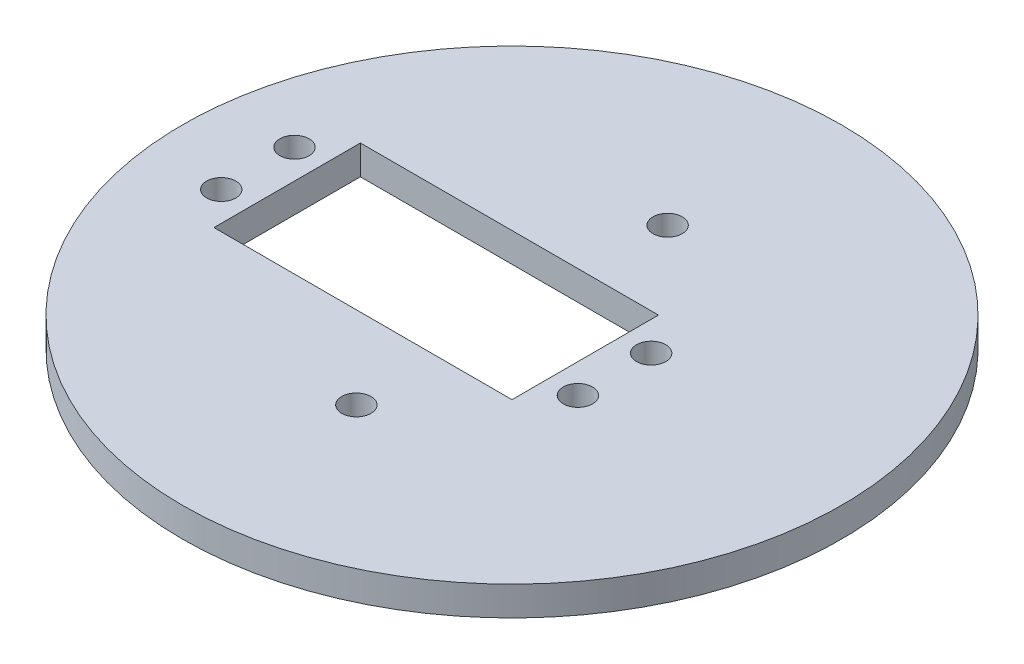
ISO-10303-21;
HEADER;
FILE_DESCRIPTION(('STEP AP214'),'2;1');
FILE_NAME('part.step','',(''),(''),'','','');
FILE_SCHEMA(('AUTOMOTIVE_DESIGN { 1 0 10303 214 1 1 1 1 }'));
ENDSEC;
DATA;
#1=APPLICATION_CONTEXT('core data for automotive mechanical design processes');
#2=APPLICATION_PROTOCOL_DEFINITION('international standard','automotive_design',2000,#1);
#3=PRODUCT_CONTEXT('',#1,'mechanical');
#4=PRODUCT('Part','Part','',(#3));
#5=PRODUCT_RELATED_PRODUCT_CATEGORY('part','',(#4));
#6=PRODUCT_DEFINITION_FORMATION('','',#4);
#7=PRODUCT_DEFINITION_CONTEXT('part definition',#1,'design');
#8=PRODUCT_DEFINITION('design','',#6,#7);
#9=PRODUCT_DEFINITION_SHAPE('','',#8);
#10=(LENGTH_UNIT() NAMED_UNIT(*) SI_UNIT(.MILLI.,.METRE.));
#11=(NAMED_UNIT(*) PLANE_ANGLE_UNIT() SI_UNIT($,.RADIAN.));
#12=(NAMED_UNIT(*) SI_UNIT($,.STERADIAN.) SOLID_ANGLE_UNIT());
#13=UNCERTAINTY_MEASURE_WITH_UNIT(LENGTH_MEASURE(1.E-05),#10,'distance_accuracy_value','');
#14=(GEOMETRIC_REPRESENTATION_CONTEXT(3) GLOBAL_UNCERTAINTY_ASSIGNED_CONTEXT((#13)) GLOBAL_UNIT_ASSIGNED_CONTEXT((#10,
#11,#12)) REPRESENTATION_CONTEXT('',''));
#15=CARTESIAN_POINT('',(0.,0.,0.));
#16=DIRECTION('',(0.,0.,1.));
#17=DIRECTION('',(1.,0.,0.));
#18=AXIS2_PLACEMENT_3D('',#15,#16,#17);
#19=CARTESIAN_POINT('',(0.,2.,0.));
#20=DIRECTION('',(0.,-1.,0.));
#21=DIRECTION('',(0.,0.,-1.));
#22=AXIS2_PLACEMENT_3D('',#19,#20,#21);
#23=CYLINDRICAL_SURFACE('',#22,45.);
#24=CARTESIAN_POINT('',(0.,2.,0.));
#25=DIRECTION('',(0.,1.,0.));
#26=DIRECTION('',(0.,0.,1.));
#27=AXIS2_PLACEMENT_3D('',#24,#25,#26);
#28=CIRCLE('',#27,45.);
#29=CARTESIAN_POINT('',(0.,2.,45.));
#30=VERTEX_POINT('',#29);
#31=EDGE_CURVE('E105',#30,#30,#28,.T.);
#32=ORIENTED_EDGE('',*,*,#31,.F.);
#33=EDGE_LOOP('',(#32));
#34=FACE_BOUND('',#33,.T.);
#35=CARTESIAN_POINT('',(0.,-2.,0.));
#36=DIRECTION('',(0.,1.,0.));
#37=DIRECTION('',(0.,0.,1.));
#38=AXIS2_PLACEMENT_3D('',#35,#36,#37);
#39=CIRCLE('',#38,45.);
#40=CARTESIAN_POINT('',(0.,-2.,45.));
#41=VERTEX_POINT('',#40);
#42=EDGE_CURVE('E102',#41,#41,#39,.T.);
#43=ORIENTED_EDGE('',*,*,#42,.T.);
#44=EDGE_LOOP('',(#43));
#45=FACE_BOUND('',#44,.T.);
#46=ADVANCED_FACE('F34',(#34,#45),#23,.T.);
#47=CARTESIAN_POINT('',(0.,2.,0.));
#48=DIRECTION('',(0.,1.,0.));
#49=DIRECTION('',(0.,0.,1.));
#50=AXIS2_PLACEMENT_3D('',#47,#48,#49);
#51=PLANE('',#50);
#52=CARTESIAN_POINT('',(14.,2.,4.99999999999995));
#53=DIRECTION('',(0.,1.,0.));
#54=DIRECTION('',(0.,0.,1.));
#55=AXIS2_PLACEMENT_3D('',#52,#53,#54);
#56=CIRCLE('',#55,2.);
#57=CARTESIAN_POINT('',(14.,2.,6.99999999999996));
#58=VERTEX_POINT('',#57);
#59=EDGE_CURVE('E142',#58,#58,#56,.T.);
#60=ORIENTED_EDGE('',*,*,#59,.F.);
#61=EDGE_LOOP('',(#60));
#62=FACE_BOUND('',#61,.T.);
#63=CARTESIAN_POINT('',(14.,2.,-5.00000000000005));
#64=DIRECTION('',(0.,1.,0.));
#65=DIRECTION('',(0.,0.,1.));
#66=AXIS2_PLACEMENT_3D('',#63,#64,#65);
#67=CIRCLE('',#66,2.);
#68=CARTESIAN_POINT('',(14.,2.,-3.00000000000005));
#69=VERTEX_POINT('',#68);
#70=EDGE_CURVE('E132',#69,#69,#67,.T.);
#71=ORIENTED_EDGE('',*,*,#70,.F.);
#72=EDGE_LOOP('',(#71));
#73=FACE_BOUND('',#72,.T.);
#74=CARTESIAN_POINT('',(0.,2.,-21.25));
#75=DIRECTION('',(0.,1.,0.));
#76=DIRECTION('',(0.,0.,1.));
#77=AXIS2_PLACEMENT_3D('',#74,#75,#76);
#78=CIRCLE('',#77,2.);
#79=CARTESIAN_POINT('',(0.,2.,-19.25));
#80=VERTEX_POINT('',#79);
#81=EDGE_CURVE('E129',#80,#80,#78,.T.);
#82=ORIENTED_EDGE('',*,*,#81,.F.);
#83=EDGE_LOOP('',(#82));
#84=FACE_BOUND('',#83,.T.);
#85=CARTESIAN_POINT('',(0.,2.,21.25));
#86=DIRECTION('',(0.,1.,0.));
#87=DIRECTION('',(0.,0.,1.));
#88=AXIS2_PLACEMENT_3D('',#85,#86,#87);
#89=CIRCLE('',#88,2.);
#90=CARTESIAN_POINT('',(0.,2.,23.25));
#91=VERTEX_POINT('',#90);
#92=EDGE_CURVE('E126',#91,#91,#89,.T.);
#93=ORIENTED_EDGE('',*,*,#92,.F.);
#94=EDGE_LOOP('',(#93));
#95=FACE_BOUND('',#94,.T.);
#96=CARTESIAN_POINT('',(-34.7,2.,4.99999999999995));
#97=DIRECTION('',(0.,1.,0.));
#98=DIRECTION('',(0.,0.,1.));
#99=AXIS2_PLACEMENT_3D('',#96,#97,#98);
#100=CIRCLE('',#99,2.);
#101=CARTESIAN_POINT('',(-34.7,2.,6.99999999999996));
#102=VERTEX_POINT('',#101);
#103=EDGE_CURVE('E122',#102,#102,#100,.T.);
#104=ORIENTED_EDGE('',*,*,#103,.F.);
#105=EDGE_LOOP('',(#104));
#106=FACE_BOUND('',#105,.T.);
#107=CARTESIAN_POINT('',(-34.7,2.,-5.00000000000005));
#108=DIRECTION('',(0.,1.,0.));
#109=DIRECTION('',(0.,0.,1.));
#110=AXIS2_PLACEMENT_3D('',#107,#108,#109);
#111=CIRCLE('',#110,2.);
#112=CARTESIAN_POINT('',(-34.7,2.,-3.00000000000005));
#113=VERTEX_POINT('',#112);
#114=EDGE_CURVE('E118',#113,#113,#111,.T.);
#115=ORIENTED_EDGE('',*,*,#114,.F.);
#116=EDGE_LOOP('',(#115));
#117=FACE_BOUND('',#116,.T.);
#118=DIRECTION('',(0.,0.,1.));
#119=VECTOR('',#118,1.);
#120=CARTESIAN_POINT('',(-30.7,2.,-10.));
#121=LINE('',#120,#119);
#122=CARTESIAN_POINT('',(-30.7,2.,-10.));
#123=VERTEX_POINT('',#122);
#124=CARTESIAN_POINT('',(-30.7,2.,9.99999999999996));
#125=VERTEX_POINT('',#124);
#126=EDGE_CURVE('E50',#123,#125,#121,.T.);
#127=ORIENTED_EDGE('',*,*,#126,.F.);
#128=DIRECTION('',(-1.,0.,0.));
#129=VECTOR('',#128,1.);
#130=CARTESIAN_POINT('',(-30.7,2.,-10.));
#131=LINE('',#130,#129);
#132=CARTESIAN_POINT('',(9.99999999999999,2.,-10.));
#133=VERTEX_POINT('',#132);
#134=EDGE_CURVE('E95',#133,#123,#131,.T.);
#135=ORIENTED_EDGE('',*,*,#134,.F.);
#136=DIRECTION('',(0.,0.,-1.));
#137=VECTOR('',#136,1.);
#138=CARTESIAN_POINT('',(9.99999999999999,2.,-10.));
#139=LINE('',#138,#137);
#140=CARTESIAN_POINT('',(9.99999999999999,2.,9.99999999999996));
#141=VERTEX_POINT('',#140);
#142=EDGE_CURVE('E79',#141,#133,#139,.T.);
#143=ORIENTED_EDGE('',*,*,#142,.F.);
#144=DIRECTION('',(1.,0.,0.));
#145=VECTOR('',#144,1.);
#146=CARTESIAN_POINT('',(-30.7,2.,9.99999999999996));
#147=LINE('',#146,#145);
#148=EDGE_CURVE('E88',#125,#141,#147,.T.);
#149=ORIENTED_EDGE('',*,*,#148,.F.);
#150=EDGE_LOOP('',(#127,#135,#143,#149));
#151=FACE_BOUND('',#150,.T.);
#152=ORIENTED_EDGE('',*,*,#31,.T.);
#153=EDGE_LOOP('',(#152));
#154=FACE_BOUND('',#153,.T.);
#155=ADVANCED_FACE('F92',(#62,#73,#84,#95,#106,#117,#151,#154),#51,.T.);
#156=CARTESIAN_POINT('',(0.,-2.,0.));
#157=DIRECTION('',(0.,1.,0.));
#158=DIRECTION('',(0.,0.,1.));
#159=AXIS2_PLACEMENT_3D('',#156,#157,#158);
#160=PLANE('',#159);
#161=CARTESIAN_POINT('',(14.,-2.,4.99999999999995));
#162=DIRECTION('',(0.,1.,0.));
#163=DIRECTION('',(0.,0.,1.));
#164=AXIS2_PLACEMENT_3D('',#161,#162,#163);
#165=CIRCLE('',#164,2.);
#166=CARTESIAN_POINT('',(14.,-2.,6.99999999999996));
#167=VERTEX_POINT('',#166);
#168=EDGE_CURVE('E37',#167,#167,#165,.T.);
#169=ORIENTED_EDGE('',*,*,#168,.T.);
#170=EDGE_LOOP('',(#169));
#171=FACE_BOUND('',#170,.T.);
#172=CARTESIAN_POINT('',(14.,-2.,-5.00000000000005));
#173=DIRECTION('',(0.,1.,0.));
#174=DIRECTION('',(0.,0.,1.));
#175=AXIS2_PLACEMENT_3D('',#172,#173,#174);
#176=CIRCLE('',#175,2.);
#177=CARTESIAN_POINT('',(14.,-2.,-3.00000000000005));
#178=VERTEX_POINT('',#177);
#179=EDGE_CURVE('E130',#178,#178,#176,.T.);
#180=ORIENTED_EDGE('',*,*,#179,.T.);
#181=EDGE_LOOP('',(#180));
#182=FACE_BOUND('',#181,.T.);
#183=CARTESIAN_POINT('',(0.,-2.,-21.25));
#184=DIRECTION('',(0.,1.,0.));
#185=DIRECTION('',(0.,0.,1.));
#186=AXIS2_PLACEMENT_3D('',#183,#184,#185);
#187=CIRCLE('',#186,2.);
#188=CARTESIAN_POINT('',(0.,-2.,-19.25));
#189=VERTEX_POINT('',#188);
#190=EDGE_CURVE('E127',#189,#189,#187,.T.);
#191=ORIENTED_EDGE('',*,*,#190,.T.);
#192=EDGE_LOOP('',(#191));
#193=FACE_BOUND('',#192,.T.);
#194=CARTESIAN_POINT('',(0.,-2.,21.25));
#195=DIRECTION('',(0.,1.,0.));
#196=DIRECTION('',(0.,0.,1.));
#197=AXIS2_PLACEMENT_3D('',#194,#195,#196);
#198=CIRCLE('',#197,2.);
#199=CARTESIAN_POINT('',(0.,-2.,23.25));
#200=VERTEX_POINT('',#199);
#201=EDGE_CURVE('E123',#200,#200,#198,.T.);
#202=ORIENTED_EDGE('',*,*,#201,.T.);
#203=EDGE_LOOP('',(#202));
#204=FACE_BOUND('',#203,.T.);
#205=CARTESIAN_POINT('',(-34.7,-2.,4.99999999999995));
#206=DIRECTION('',(0.,1.,0.));
#207=DIRECTION('',(0.,0.,1.));
#208=AXIS2_PLACEMENT_3D('',#205,#206,#207);
#209=CIRCLE('',#208,2.);
#210=CARTESIAN_POINT('',(-34.7,-2.,6.99999999999996));
#211=VERTEX_POINT('',#210);
#212=EDGE_CURVE('E119',#211,#211,#209,.T.);
#213=ORIENTED_EDGE('',*,*,#212,.T.);
#214=EDGE_LOOP('',(#213));
#215=FACE_BOUND('',#214,.T.);
#216=CARTESIAN_POINT('',(-34.7,-2.,-5.00000000000005));
#217=DIRECTION('',(0.,1.,0.));
#218=DIRECTION('',(0.,0.,1.));
#219=AXIS2_PLACEMENT_3D('',#216,#217,#218);
#220=CIRCLE('',#219,2.);
#221=CARTESIAN_POINT('',(-34.7,-2.,-3.00000000000005));
#222=VERTEX_POINT('',#221);
#223=EDGE_CURVE('E115',#222,#222,#220,.T.);
#224=ORIENTED_EDGE('',*,*,#223,.T.);
#225=EDGE_LOOP('',(#224));
#226=FACE_BOUND('',#225,.T.);
#227=DIRECTION('',(-1.,0.,0.));
#228=VECTOR('',#227,1.);
#229=CARTESIAN_POINT('',(0.,-2.,-10.));
#230=LINE('',#229,#228);
#231=CARTESIAN_POINT('',(9.99999999999999,-2.,-10.));
#232=VERTEX_POINT('',#231);
#233=CARTESIAN_POINT('',(-30.7,-2.,-10.));
#234=VERTEX_POINT('',#233);
#235=EDGE_CURVE('E42',#232,#234,#230,.T.);
#236=ORIENTED_EDGE('',*,*,#235,.T.);
#237=DIRECTION('',(0.,0.,1.));
#238=VECTOR('',#237,1.);
#239=CARTESIAN_POINT('',(-30.7,-2.,0.));
#240=LINE('',#239,#238);
#241=CARTESIAN_POINT('',(-30.7,-2.,9.99999999999996));
#242=VERTEX_POINT('',#241);
#243=EDGE_CURVE('E11',#234,#242,#240,.T.);
#244=ORIENTED_EDGE('',*,*,#243,.T.);
#245=DIRECTION('',(1.,0.,0.));
#246=VECTOR('',#245,1.);
#247=CARTESIAN_POINT('',(0.,-2.,9.99999999999996));
#248=LINE('',#247,#246);
#249=CARTESIAN_POINT('',(9.99999999999999,-2.,9.99999999999996));
#250=VERTEX_POINT('',#249);
#251=EDGE_CURVE('E108',#242,#250,#248,.T.);
#252=ORIENTED_EDGE('',*,*,#251,.T.);
#253=DIRECTION('',(0.,0.,-1.));
#254=VECTOR('',#253,1.);
#255=CARTESIAN_POINT('',(9.99999999999999,-2.,0.));
#256=LINE('',#255,#254);
#257=EDGE_CURVE('E82',#250,#232,#256,.T.);
#258=ORIENTED_EDGE('',*,*,#257,.T.);
#259=EDGE_LOOP('',(#236,#244,#252,#258));
#260=FACE_BOUND('',#259,.T.);
#261=ORIENTED_EDGE('',*,*,#42,.F.);
#262=EDGE_LOOP('',(#261));
#263=FACE_BOUND('',#262,.T.);
#264=ADVANCED_FACE('F156',(#171,#182,#193,#204,#215,#226,#260,#263),#160,.F.);
#265=CARTESIAN_POINT('',(-30.7,-8.,-10.));
#266=DIRECTION('',(-1.,0.,0.));
#267=DIRECTION('',(0.,0.,1.));
#268=AXIS2_PLACEMENT_3D('',#265,#266,#267);
#269=PLANE('',#268);
#270=DIRECTION('',(0.,1.,0.));
#271=VECTOR('',#270,1.);
#272=CARTESIAN_POINT('',(-30.7,-8.,-10.));
#273=LINE('',#272,#271);
#274=EDGE_CURVE('E100',#234,#123,#273,.T.);
#275=ORIENTED_EDGE('',*,*,#274,.T.);
#276=ORIENTED_EDGE('',*,*,#126,.T.);
#277=DIRECTION('',(0.,1.,0.));
#278=VECTOR('',#277,1.);
#279=CARTESIAN_POINT('',(-30.7,-8.,9.99999999999996));
#280=LINE('',#279,#278);
#281=EDGE_CURVE('E85',#242,#125,#280,.T.);
#282=ORIENTED_EDGE('',*,*,#281,.F.);
#283=ORIENTED_EDGE('',*,*,#243,.F.);
#284=EDGE_LOOP('',(#275,#276,#282,#283));
#285=FACE_BOUND('',#284,.T.);
#286=ADVANCED_FACE('F163',(#285),#269,.F.);
#287=CARTESIAN_POINT('',(-30.7,-8.,-10.));
#288=DIRECTION('',(0.,0.,-1.));
#289=DIRECTION('',(-1.,0.,0.));
#290=AXIS2_PLACEMENT_3D('',#287,#288,#289);
#291=PLANE('',#290);
#292=DIRECTION('',(0.,1.,0.));
#293=VECTOR('',#292,1.);
#294=CARTESIAN_POINT('',(9.99999999999999,-8.,-10.));
#295=LINE('',#294,#293);
#296=EDGE_CURVE('E84',#232,#133,#295,.T.);
#297=ORIENTED_EDGE('',*,*,#296,.T.);
#298=ORIENTED_EDGE('',*,*,#134,.T.);
#299=ORIENTED_EDGE('',*,*,#274,.F.);
#300=ORIENTED_EDGE('',*,*,#235,.F.);
#301=EDGE_LOOP('',(#297,#298,#299,#300));
#302=FACE_BOUND('',#301,.T.);
#303=ADVANCED_FACE('F171',(#302),#291,.F.);
#304=CARTESIAN_POINT('',(9.99999999999999,-8.,-10.));
#305=DIRECTION('',(1.,0.,0.));
#306=DIRECTION('',(0.,0.,-1.));
#307=AXIS2_PLACEMENT_3D('',#304,#305,#306);
#308=PLANE('',#307);
#309=DIRECTION('',(0.,1.,0.));
#310=VECTOR('',#309,1.);
#311=CARTESIAN_POINT('',(9.99999999999999,-8.,9.99999999999996));
#312=LINE('',#311,#310);
#313=EDGE_CURVE('E58',#250,#141,#312,.T.);
#314=ORIENTED_EDGE('',*,*,#313,.T.);
#315=ORIENTED_EDGE('',*,*,#142,.T.);
#316=ORIENTED_EDGE('',*,*,#296,.F.);
#317=ORIENTED_EDGE('',*,*,#257,.F.);
#318=EDGE_LOOP('',(#314,#315,#316,#317));
#319=FACE_BOUND('',#318,.T.);
#320=ADVANCED_FACE('F76',(#319),#308,.F.);
#321=CARTESIAN_POINT('',(-30.7,-8.,9.99999999999996));
#322=DIRECTION('',(0.,0.,1.));
#323=DIRECTION('',(1.,0.,0.));
#324=AXIS2_PLACEMENT_3D('',#321,#322,#323);
#325=PLANE('',#324);
#326=ORIENTED_EDGE('',*,*,#281,.T.);
#327=ORIENTED_EDGE('',*,*,#148,.T.);
#328=ORIENTED_EDGE('',*,*,#313,.F.);
#329=ORIENTED_EDGE('',*,*,#251,.F.);
#330=EDGE_LOOP('',(#326,#327,#328,#329));
#331=FACE_BOUND('',#330,.T.);
#332=ADVANCED_FACE('F89',(#331),#325,.F.);
#333=CARTESIAN_POINT('',(-34.7,-8.,-5.00000000000005));
#334=DIRECTION('',(0.,1.,0.));
#335=DIRECTION('',(0.,0.,1.));
#336=AXIS2_PLACEMENT_3D('',#333,#334,#335);
#337=CYLINDRICAL_SURFACE('',#336,2.);
#338=ORIENTED_EDGE('',*,*,#114,.T.);
#339=EDGE_LOOP('',(#338));
#340=FACE_BOUND('',#339,.T.);
#341=ORIENTED_EDGE('',*,*,#223,.F.);
#342=EDGE_LOOP('',(#341));
#343=FACE_BOUND('',#342,.T.);
#344=ADVANCED_FACE('F152',(#340,#343),#337,.F.);
#345=CARTESIAN_POINT('',(-34.7,-8.,4.99999999999995));
#346=DIRECTION('',(0.,1.,0.));
#347=DIRECTION('',(0.,0.,1.));
#348=AXIS2_PLACEMENT_3D('',#345,#346,#347);
#349=CYLINDRICAL_SURFACE('',#348,2.);
#350=ORIENTED_EDGE('',*,*,#103,.T.);
#351=EDGE_LOOP('',(#350));
#352=FACE_BOUND('',#351,.T.);
#353=ORIENTED_EDGE('',*,*,#212,.F.);
#354=EDGE_LOOP('',(#353));
#355=FACE_BOUND('',#354,.T.);
#356=ADVANCED_FACE('F181',(#352,#355),#349,.F.);
#357=CARTESIAN_POINT('',(0.,-8.,21.25));
#358=DIRECTION('',(0.,1.,0.));
#359=DIRECTION('',(0.,0.,1.));
#360=AXIS2_PLACEMENT_3D('',#357,#358,#359);
#361=CYLINDRICAL_SURFACE('',#360,2.);
#362=ORIENTED_EDGE('',*,*,#92,.T.);
#363=EDGE_LOOP('',(#362));
#364=FACE_BOUND('',#363,.T.);
#365=ORIENTED_EDGE('',*,*,#201,.F.);
#366=EDGE_LOOP('',(#365));
#367=FACE_BOUND('',#366,.T.);
#368=ADVANCED_FACE('F184',(#364,#367),#361,.F.);
#369=CARTESIAN_POINT('',(0.,-8.,-21.25));
#370=DIRECTION('',(0.,1.,0.));
#371=DIRECTION('',(0.,0.,1.));
#372=AXIS2_PLACEMENT_3D('',#369,#370,#371);
#373=CYLINDRICAL_SURFACE('',#372,2.);
#374=ORIENTED_EDGE('',*,*,#81,.T.);
#375=EDGE_LOOP('',(#374));
#376=FACE_BOUND('',#375,.T.);
#377=ORIENTED_EDGE('',*,*,#190,.F.);
#378=EDGE_LOOP('',(#377));
#379=FACE_BOUND('',#378,.T.);
#380=ADVANCED_FACE('F188',(#376,#379),#373,.F.);
#381=CARTESIAN_POINT('',(14.,-8.,-5.00000000000005));
#382=DIRECTION('',(0.,1.,0.));
#383=DIRECTION('',(0.,0.,1.));
#384=AXIS2_PLACEMENT_3D('',#381,#382,#383);
#385=CYLINDRICAL_SURFACE('',#384,2.);
#386=ORIENTED_EDGE('',*,*,#70,.T.);
#387=EDGE_LOOP('',(#386));
#388=FACE_BOUND('',#387,.T.);
#389=ORIENTED_EDGE('',*,*,#179,.F.);
#390=EDGE_LOOP('',(#389));
#391=FACE_BOUND('',#390,.T.);
#392=ADVANCED_FACE('F192',(#388,#391),#385,.F.);
#393=CARTESIAN_POINT('',(14.,-8.,4.99999999999995));
#394=DIRECTION('',(0.,1.,0.));
#395=DIRECTION('',(0.,0.,1.));
#396=AXIS2_PLACEMENT_3D('',#393,#394,#395);
#397=CYLINDRICAL_SURFACE('',#396,2.);
#398=ORIENTED_EDGE('',*,*,#59,.T.);
#399=EDGE_LOOP('',(#398));
#400=FACE_BOUND('',#399,.T.);
#401=ORIENTED_EDGE('',*,*,#168,.F.);
#402=EDGE_LOOP('',(#401));
#403=FACE_BOUND('',#402,.T.);
#404=ADVANCED_FACE('F196',(#400,#403),#397,.F.);
#405=CLOSED_SHELL('',(#46,#155,#264,#286,#303,#320,#332,#344,#356,#368,#380,#392,#404));
#406=MANIFOLD_SOLID_BREP('B2',#405);
#407=ADVANCED_BREP_SHAPE_REPRESENTATION('',(#18,#406),#14);
#408=SHAPE_DEFINITION_REPRESENTATION(#9,#407);
ENDSEC;
END-ISO-10303-21;
